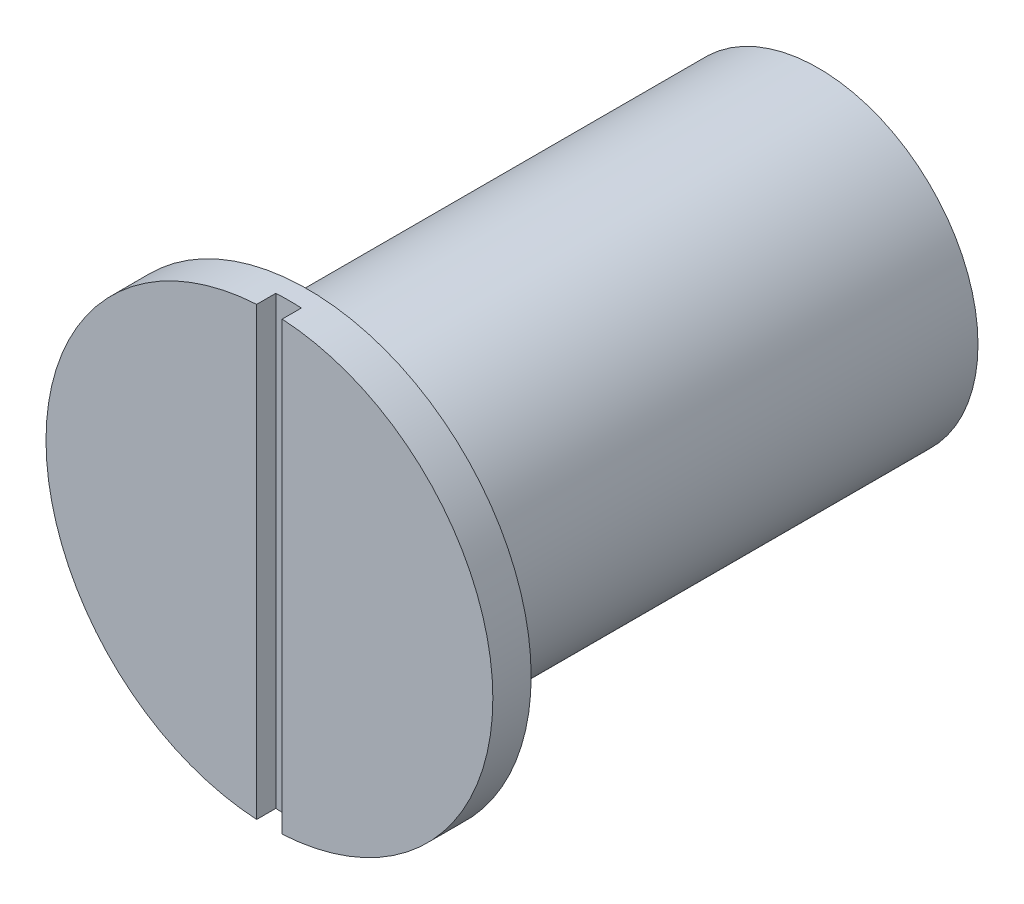
ISO-10303-21;
HEADER;
FILE_DESCRIPTION(('STEP AP214'),'2;1');
FILE_NAME('part.step','',(''),(''),'','','');
FILE_SCHEMA(('AUTOMOTIVE_DESIGN { 1 0 10303 214 1 1 1 1 }'));
ENDSEC;
DATA;
#1=APPLICATION_CONTEXT('core data for automotive mechanical design processes');
#2=APPLICATION_PROTOCOL_DEFINITION('international standard','automotive_design',2000,#1);
#3=PRODUCT_CONTEXT('',#1,'mechanical');
#4=PRODUCT('Part','Part','',(#3));
#5=PRODUCT_RELATED_PRODUCT_CATEGORY('part','',(#4));
#6=PRODUCT_DEFINITION_FORMATION('','',#4);
#7=PRODUCT_DEFINITION_CONTEXT('part definition',#1,'design');
#8=PRODUCT_DEFINITION('design','',#6,#7);
#9=PRODUCT_DEFINITION_SHAPE('','',#8);
#10=(LENGTH_UNIT() NAMED_UNIT(*) SI_UNIT(.MILLI.,.METRE.));
#11=(NAMED_UNIT(*) PLANE_ANGLE_UNIT() SI_UNIT($,.RADIAN.));
#12=(NAMED_UNIT(*) SI_UNIT($,.STERADIAN.) SOLID_ANGLE_UNIT());
#13=UNCERTAINTY_MEASURE_WITH_UNIT(LENGTH_MEASURE(1.E-05),#10,'distance_accuracy_value','');
#14=(GEOMETRIC_REPRESENTATION_CONTEXT(3) GLOBAL_UNCERTAINTY_ASSIGNED_CONTEXT((#13)) GLOBAL_UNIT_ASSIGNED_CONTEXT((#10,
#11,#12)) REPRESENTATION_CONTEXT('',''));
#15=CARTESIAN_POINT('',(0.,0.,0.));
#16=DIRECTION('',(0.,0.,1.));
#17=DIRECTION('',(1.,0.,0.));
#18=AXIS2_PLACEMENT_3D('',#15,#16,#17);
#19=CARTESIAN_POINT('',(0.,0.,0.));
#20=DIRECTION('',(0.,0.,1.));
#21=DIRECTION('',(1.,0.,0.));
#22=AXIS2_PLACEMENT_3D('',#19,#20,#21);
#23=PLANE('',#22);
#24=CARTESIAN_POINT('',(0.,0.,0.));
#25=DIRECTION('',(0.,0.,1.));
#26=DIRECTION('',(1.,0.,0.));
#27=AXIS2_PLACEMENT_3D('',#24,#25,#26);
#28=CIRCLE('',#27,1.35);
#29=CARTESIAN_POINT('',(1.35,0.,0.));
#30=VERTEX_POINT('',#29);
#31=EDGE_CURVE('E11',#30,#30,#28,.T.);
#32=ORIENTED_EDGE('',*,*,#31,.T.);
#33=EDGE_LOOP('',(#32));
#34=FACE_BOUND('',#33,.T.);
#35=CARTESIAN_POINT('',(0.,0.,0.));
#36=DIRECTION('',(0.,0.,1.));
#37=DIRECTION('',(1.,0.,0.));
#38=AXIS2_PLACEMENT_3D('',#35,#36,#37);
#39=CIRCLE('',#38,1.75);
#40=CARTESIAN_POINT('',(1.75,0.,0.));
#41=VERTEX_POINT('',#40);
#42=EDGE_CURVE('E105',#41,#41,#39,.T.);
#43=ORIENTED_EDGE('',*,*,#42,.F.);
#44=EDGE_LOOP('',(#43));
#45=FACE_BOUND('',#44,.T.);
#46=ADVANCED_FACE('F32',(#34,#45),#23,.F.);
#47=CARTESIAN_POINT('',(0.,0.,0.3));
#48=DIRECTION('',(0.,0.,1.));
#49=DIRECTION('',(1.,0.,0.));
#50=AXIS2_PLACEMENT_3D('',#47,#48,#49);
#51=PLANE('',#50);
#52=DIRECTION('',(0.,1.,0.));
#53=VECTOR('',#52,1.);
#54=CARTESIAN_POINT('',(0.1,1.74714052096562,0.3));
#55=LINE('',#54,#53);
#56=CARTESIAN_POINT('',(0.1,-1.74714052096562,0.3));
#57=VERTEX_POINT('',#56);
#58=CARTESIAN_POINT('',(0.1,1.74714052096562,0.3));
#59=VERTEX_POINT('',#58);
#60=EDGE_CURVE('E70',#57,#59,#55,.T.);
#61=ORIENTED_EDGE('',*,*,#60,.F.);
#62=CARTESIAN_POINT('',(0.,0.,0.3));
#63=DIRECTION('',(0.,0.,1.));
#64=DIRECTION('',(1.,0.,0.));
#65=AXIS2_PLACEMENT_3D('',#62,#63,#64);
#66=CIRCLE('',#65,1.75);
#67=EDGE_CURVE('E108',#57,#59,#66,.T.);
#68=ORIENTED_EDGE('',*,*,#67,.T.);
#69=EDGE_LOOP('',(#61,#68));
#70=FACE_BOUND('',#69,.T.);
#71=ADVANCED_FACE('F135',(#70),#51,.T.);
#72=CARTESIAN_POINT('',(0.,0.,0.3));
#73=DIRECTION('',(0.,0.,-1.));
#74=DIRECTION('',(-1.,0.,0.));
#75=AXIS2_PLACEMENT_3D('',#72,#73,#74);
#76=CYLINDRICAL_SURFACE('',#75,1.75);
#77=CARTESIAN_POINT('',(0.,0.,0.15));
#78=DIRECTION('',(0.,0.,1.));
#79=DIRECTION('',(1.,0.,0.));
#80=AXIS2_PLACEMENT_3D('',#77,#78,#79);
#81=CIRCLE('',#80,1.75);
#82=CARTESIAN_POINT('',(0.1,1.74714052096562,0.15));
#83=VERTEX_POINT('',#82);
#84=CARTESIAN_POINT('',(-0.1,1.74714052096562,0.15));
#85=VERTEX_POINT('',#84);
#86=EDGE_CURVE('E90',#83,#85,#81,.T.);
#87=ORIENTED_EDGE('',*,*,#86,.F.);
#88=DIRECTION('',(0.,0.,1.));
#89=VECTOR('',#88,1.);
#90=CARTESIAN_POINT('',(0.1,1.74714052096562,0.15));
#91=LINE('',#90,#89);
#92=EDGE_CURVE('E56',#83,#59,#91,.T.);
#93=ORIENTED_EDGE('',*,*,#92,.T.);
#94=ORIENTED_EDGE('',*,*,#67,.F.);
#95=DIRECTION('',(0.,0.,1.));
#96=VECTOR('',#95,1.);
#97=CARTESIAN_POINT('',(0.1,-1.74714052096562,0.15));
#98=LINE('',#97,#96);
#99=CARTESIAN_POINT('',(0.1,-1.74714052096562,0.15));
#100=VERTEX_POINT('',#99);
#101=EDGE_CURVE('E84',#100,#57,#98,.T.);
#102=ORIENTED_EDGE('',*,*,#101,.F.);
#103=CARTESIAN_POINT('',(0.,0.,0.15));
#104=DIRECTION('',(0.,0.,1.));
#105=DIRECTION('',(1.,0.,0.));
#106=AXIS2_PLACEMENT_3D('',#103,#104,#105);
#107=CIRCLE('',#106,1.75);
#108=CARTESIAN_POINT('',(-0.100000000000001,-1.74714052096562,0.15));
#109=VERTEX_POINT('',#108);
#110=EDGE_CURVE('E88',#109,#100,#107,.T.);
#111=ORIENTED_EDGE('',*,*,#110,.F.);
#112=DIRECTION('',(0.,0.,1.));
#113=VECTOR('',#112,1.);
#114=CARTESIAN_POINT('',(-0.100000000000001,-1.74714052096562,0.15));
#115=LINE('',#114,#113);
#116=CARTESIAN_POINT('',(-0.100000000000001,-1.74714052096562,0.3));
#117=VERTEX_POINT('',#116);
#118=EDGE_CURVE('E77',#109,#117,#115,.T.);
#119=ORIENTED_EDGE('',*,*,#118,.T.);
#120=CARTESIAN_POINT('',(-0.1,1.74714052096562,0.3));
#121=VERTEX_POINT('',#120);
#122=EDGE_CURVE('E111',#121,#117,#66,.T.);
#123=ORIENTED_EDGE('',*,*,#122,.F.);
#124=DIRECTION('',(0.,0.,1.));
#125=VECTOR('',#124,1.);
#126=CARTESIAN_POINT('',(-0.1,1.74714052096562,0.15));
#127=LINE('',#126,#125);
#128=EDGE_CURVE('E47',#85,#121,#127,.T.);
#129=ORIENTED_EDGE('',*,*,#128,.F.);
#130=EDGE_LOOP('',(#87,#93,#94,#102,#111,#119,#123,#129));
#131=FACE_BOUND('',#130,.T.);
#132=ORIENTED_EDGE('',*,*,#42,.T.);
#133=EDGE_LOOP('',(#132));
#134=FACE_BOUND('',#133,.T.);
#135=ADVANCED_FACE('F93',(#131,#134),#76,.T.);
#136=DIRECTION('',(0.,-1.,0.));
#137=VECTOR('',#136,1.);
#138=CARTESIAN_POINT('',(-0.1,1.74714052096562,0.3));
#139=LINE('',#138,#137);
#140=EDGE_CURVE('E79',#121,#117,#139,.T.);
#141=ORIENTED_EDGE('',*,*,#140,.F.);
#142=ORIENTED_EDGE('',*,*,#122,.T.);
#143=EDGE_LOOP('',(#141,#142));
#144=FACE_BOUND('',#143,.T.);
#145=ADVANCED_FACE('F117',(#144),#51,.T.);
#146=CARTESIAN_POINT('',(0.1,1.74714052096562,0.15));
#147=DIRECTION('',(1.,0.,0.));
#148=DIRECTION('',(0.,0.,-1.));
#149=AXIS2_PLACEMENT_3D('',#146,#147,#148);
#150=PLANE('',#149);
#151=ORIENTED_EDGE('',*,*,#60,.T.);
#152=ORIENTED_EDGE('',*,*,#92,.F.);
#153=DIRECTION('',(0.,1.,0.));
#154=VECTOR('',#153,1.);
#155=CARTESIAN_POINT('',(0.1,1.74714052096562,0.15));
#156=LINE('',#155,#154);
#157=EDGE_CURVE('E96',#100,#83,#156,.T.);
#158=ORIENTED_EDGE('',*,*,#157,.F.);
#159=ORIENTED_EDGE('',*,*,#101,.T.);
#160=EDGE_LOOP('',(#151,#152,#158,#159));
#161=FACE_BOUND('',#160,.T.);
#162=ADVANCED_FACE('F150',(#161),#150,.F.);
#163=CARTESIAN_POINT('',(-0.1,1.74714052096562,0.15));
#164=DIRECTION('',(-1.,0.,0.));
#165=DIRECTION('',(0.,0.,1.));
#166=AXIS2_PLACEMENT_3D('',#163,#164,#165);
#167=PLANE('',#166);
#168=ORIENTED_EDGE('',*,*,#140,.T.);
#169=ORIENTED_EDGE('',*,*,#118,.F.);
#170=DIRECTION('',(0.,-1.,0.));
#171=VECTOR('',#170,1.);
#172=CARTESIAN_POINT('',(-0.1,1.74714052096562,0.15));
#173=LINE('',#172,#171);
#174=EDGE_CURVE('E74',#85,#109,#173,.T.);
#175=ORIENTED_EDGE('',*,*,#174,.F.);
#176=ORIENTED_EDGE('',*,*,#128,.T.);
#177=EDGE_LOOP('',(#168,#169,#175,#176));
#178=FACE_BOUND('',#177,.T.);
#179=ADVANCED_FACE('F78',(#178),#167,.F.);
#180=CARTESIAN_POINT('',(0.,0.,0.15));
#181=DIRECTION('',(0.,0.,1.));
#182=DIRECTION('',(1.,0.,0.));
#183=AXIS2_PLACEMENT_3D('',#180,#181,#182);
#184=PLANE('',#183);
#185=ORIENTED_EDGE('',*,*,#86,.T.);
#186=ORIENTED_EDGE('',*,*,#174,.T.);
#187=ORIENTED_EDGE('',*,*,#110,.T.);
#188=ORIENTED_EDGE('',*,*,#157,.T.);
#189=EDGE_LOOP('',(#185,#186,#187,#188));
#190=FACE_BOUND('',#189,.T.);
#191=ADVANCED_FACE('F87',(#190),#184,.T.);
#192=CARTESIAN_POINT('',(0.,0.,-4.));
#193=DIRECTION('',(0.,0.,1.));
#194=DIRECTION('',(1.,0.,0.));
#195=AXIS2_PLACEMENT_3D('',#192,#193,#194);
#196=CYLINDRICAL_SURFACE('',#195,1.25);
#197=CARTESIAN_POINT('',(0.,0.,-0.0999999999999998));
#198=DIRECTION('',(0.,0.,1.));
#199=DIRECTION('',(1.,0.,0.));
#200=AXIS2_PLACEMENT_3D('',#197,#198,#199);
#201=CIRCLE('',#200,1.25);
#202=CARTESIAN_POINT('',(1.25,0.,-0.0999999999999998));
#203=VERTEX_POINT('',#202);
#204=EDGE_CURVE('E40',#203,#203,#201,.F.);
#205=ORIENTED_EDGE('',*,*,#204,.T.);
#206=EDGE_LOOP('',(#205));
#207=FACE_BOUND('',#206,.T.);
#208=CARTESIAN_POINT('',(0.,0.,-4.));
#209=DIRECTION('',(0.,0.,-1.));
#210=DIRECTION('',(-1.,0.,0.));
#211=AXIS2_PLACEMENT_3D('',#208,#209,#210);
#212=CIRCLE('',#211,1.25);
#213=CARTESIAN_POINT('',(-1.25,0.,-4.));
#214=VERTEX_POINT('',#213);
#215=EDGE_CURVE('E102',#214,#214,#212,.T.);
#216=ORIENTED_EDGE('',*,*,#215,.F.);
#217=EDGE_LOOP('',(#216));
#218=FACE_BOUND('',#217,.T.);
#219=ADVANCED_FACE('F124',(#207,#218),#196,.T.);
#220=CARTESIAN_POINT('',(0.,0.,-4.));
#221=DIRECTION('',(0.,0.,-1.));
#222=DIRECTION('',(-1.,0.,0.));
#223=AXIS2_PLACEMENT_3D('',#220,#221,#222);
#224=PLANE('',#223);
#225=ORIENTED_EDGE('',*,*,#215,.T.);
#226=EDGE_LOOP('',(#225));
#227=FACE_BOUND('',#226,.T.);
#228=ADVANCED_FACE('F122',(#227),#224,.T.);
#229=CARTESIAN_POINT('',(0.,0.,-0.0999999999999998));
#230=DIRECTION('',(0.,0.,1.));
#231=DIRECTION('',(1.,0.,0.));
#232=AXIS2_PLACEMENT_3D('',#229,#230,#231);
#233=TOROIDAL_SURFACE('',#232,1.35,0.1);
#234=ORIENTED_EDGE('',*,*,#31,.F.);
#235=EDGE_LOOP('',(#234));
#236=FACE_BOUND('',#235,.T.);
#237=ORIENTED_EDGE('',*,*,#204,.F.);
#238=EDGE_LOOP('',(#237));
#239=FACE_BOUND('',#238,.T.);
#240=ADVANCED_FACE('F34',(#236,#239),#233,.F.);
#241=CLOSED_SHELL('',(#46,#71,#135,#145,#162,#179,#191,#219,#228,#240));
#242=MANIFOLD_SOLID_BREP('B2',#241);
#243=ADVANCED_BREP_SHAPE_REPRESENTATION('',(#18,#242),#14);
#244=SHAPE_DEFINITION_REPRESENTATION(#9,#243);
ENDSEC;
END-ISO-10303-21;
